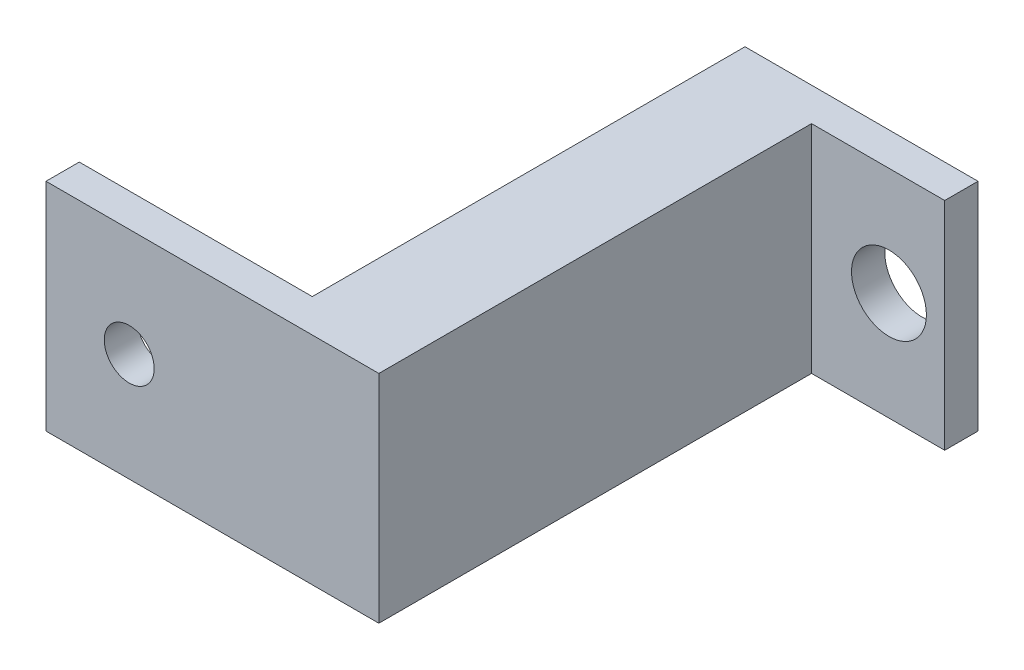
ISO-10303-21;
HEADER;
FILE_DESCRIPTION(('STEP AP214'),'2;1');
FILE_NAME('part.step','',(''),(''),'','','');
FILE_SCHEMA(('AUTOMOTIVE_DESIGN { 1 0 10303 214 1 1 1 1 }'));
ENDSEC;
DATA;
#1=APPLICATION_CONTEXT('core data for automotive mechanical design processes');
#2=APPLICATION_PROTOCOL_DEFINITION('international standard','automotive_design',2000,#1);
#3=PRODUCT_CONTEXT('',#1,'mechanical');
#4=PRODUCT('Part','Part','',(#3));
#5=PRODUCT_RELATED_PRODUCT_CATEGORY('part','',(#4));
#6=PRODUCT_DEFINITION_FORMATION('','',#4);
#7=PRODUCT_DEFINITION_CONTEXT('part definition',#1,'design');
#8=PRODUCT_DEFINITION('design','',#6,#7);
#9=PRODUCT_DEFINITION_SHAPE('','',#8);
#10=(LENGTH_UNIT() NAMED_UNIT(*) SI_UNIT(.MILLI.,.METRE.));
#11=(NAMED_UNIT(*) PLANE_ANGLE_UNIT() SI_UNIT($,.RADIAN.));
#12=(NAMED_UNIT(*) SI_UNIT($,.STERADIAN.) SOLID_ANGLE_UNIT());
#13=UNCERTAINTY_MEASURE_WITH_UNIT(LENGTH_MEASURE(1.E-05),#10,'distance_accuracy_value','');
#14=(GEOMETRIC_REPRESENTATION_CONTEXT(3) GLOBAL_UNCERTAINTY_ASSIGNED_CONTEXT((#13)) GLOBAL_UNIT_ASSIGNED_CONTEXT((#10,
#11,#12)) REPRESENTATION_CONTEXT('',''));
#15=CARTESIAN_POINT('',(0.,0.,0.));
#16=DIRECTION('',(0.,0.,1.));
#17=DIRECTION('',(1.,0.,0.));
#18=AXIS2_PLACEMENT_3D('',#15,#16,#17);
#19=CARTESIAN_POINT('',(0.,0.,2.));
#20=DIRECTION('',(0.,0.,-1.));
#21=DIRECTION('',(-1.,0.,0.));
#22=AXIS2_PLACEMENT_3D('',#19,#20,#21);
#23=PLANE('',#22);
#24=CARTESIAN_POINT('',(3.65,0.,2.));
#25=DIRECTION('',(0.,0.,1.));
#26=DIRECTION('',(1.,0.,0.));
#27=AXIS2_PLACEMENT_3D('',#24,#25,#26);
#28=CIRCLE('',#27,2.25);
#29=CARTESIAN_POINT('',(5.9,0.,2.));
#30=VERTEX_POINT('',#29);
#31=EDGE_CURVE('E105',#30,#30,#28,.T.);
#32=ORIENTED_EDGE('',*,*,#31,.F.);
#33=EDGE_LOOP('',(#32));
#34=FACE_BOUND('',#33,.T.);
#35=DIRECTION('',(0.,1.,0.));
#36=VECTOR('',#35,1.);
#37=CARTESIAN_POINT('',(-0.999999999999998,6.5,2.));
#38=LINE('',#37,#36);
#39=CARTESIAN_POINT('',(-0.999999999999997,-6.5,2.));
#40=VERTEX_POINT('',#39);
#41=CARTESIAN_POINT('',(-0.999999999999998,6.5,2.));
#42=VERTEX_POINT('',#41);
#43=EDGE_CURVE('E55',#40,#42,#38,.T.);
#44=ORIENTED_EDGE('',*,*,#43,.F.);
#45=DIRECTION('',(1.,0.,0.));
#46=VECTOR('',#45,1.);
#47=CARTESIAN_POINT('',(-7.,-6.5,2.));
#48=LINE('',#47,#46);
#49=CARTESIAN_POINT('',(7.,-6.5,2.));
#50=VERTEX_POINT('',#49);
#51=EDGE_CURVE('E60',#40,#50,#48,.T.);
#52=ORIENTED_EDGE('',*,*,#51,.T.);
#53=DIRECTION('',(0.,1.,0.));
#54=VECTOR('',#53,1.);
#55=CARTESIAN_POINT('',(7.,-6.5,2.));
#56=LINE('',#55,#54);
#57=CARTESIAN_POINT('',(7.,6.5,2.));
#58=VERTEX_POINT('',#57);
#59=EDGE_CURVE('E92',#50,#58,#56,.T.);
#60=ORIENTED_EDGE('',*,*,#59,.T.);
#61=DIRECTION('',(-1.,0.,0.));
#62=VECTOR('',#61,1.);
#63=CARTESIAN_POINT('',(-7.,6.5,2.));
#64=LINE('',#63,#62);
#65=EDGE_CURVE('E214',#58,#42,#64,.T.);
#66=ORIENTED_EDGE('',*,*,#65,.T.);
#67=EDGE_LOOP('',(#44,#52,#60,#66));
#68=FACE_BOUND('',#67,.T.);
#69=ADVANCED_FACE('F39',(#34,#68),#23,.F.);
#70=CARTESIAN_POINT('',(0.,0.,0.));
#71=DIRECTION('',(0.,0.,-1.));
#72=DIRECTION('',(-1.,0.,0.));
#73=AXIS2_PLACEMENT_3D('',#70,#71,#72);
#74=PLANE('',#73);
#75=DIRECTION('',(0.,1.,0.));
#76=VECTOR('',#75,1.);
#77=CARTESIAN_POINT('',(7.,-6.5,0.));
#78=LINE('',#77,#76);
#79=CARTESIAN_POINT('',(7.,-6.5,0.));
#80=VERTEX_POINT('',#79);
#81=CARTESIAN_POINT('',(7.,6.5,0.));
#82=VERTEX_POINT('',#81);
#83=EDGE_CURVE('E98',#80,#82,#78,.T.);
#84=ORIENTED_EDGE('',*,*,#83,.F.);
#85=DIRECTION('',(1.,0.,0.));
#86=VECTOR('',#85,1.);
#87=CARTESIAN_POINT('',(-7.,-6.5,0.));
#88=LINE('',#87,#86);
#89=CARTESIAN_POINT('',(-7.,-6.5,0.));
#90=VERTEX_POINT('',#89);
#91=EDGE_CURVE('E80',#90,#80,#88,.T.);
#92=ORIENTED_EDGE('',*,*,#91,.F.);
#93=DIRECTION('',(0.,-1.,0.));
#94=VECTOR('',#93,1.);
#95=CARTESIAN_POINT('',(-7.,-6.5,0.));
#96=LINE('',#95,#94);
#97=CARTESIAN_POINT('',(-7.,6.5,0.));
#98=VERTEX_POINT('',#97);
#99=EDGE_CURVE('E93',#98,#90,#96,.T.);
#100=ORIENTED_EDGE('',*,*,#99,.F.);
#101=DIRECTION('',(-1.,0.,0.));
#102=VECTOR('',#101,1.);
#103=CARTESIAN_POINT('',(-7.,6.5,0.));
#104=LINE('',#103,#102);
#105=EDGE_CURVE('E103',#82,#98,#104,.T.);
#106=ORIENTED_EDGE('',*,*,#105,.F.);
#107=EDGE_LOOP('',(#84,#92,#100,#106));
#108=FACE_BOUND('',#107,.T.);
#109=CARTESIAN_POINT('',(3.65,0.,0.));
#110=DIRECTION('',(0.,0.,1.));
#111=DIRECTION('',(1.,0.,0.));
#112=AXIS2_PLACEMENT_3D('',#109,#110,#111);
#113=CIRCLE('',#112,2.25);
#114=CARTESIAN_POINT('',(5.9,0.,0.));
#115=VERTEX_POINT('',#114);
#116=EDGE_CURVE('E111',#115,#115,#113,.T.);
#117=ORIENTED_EDGE('',*,*,#116,.T.);
#118=EDGE_LOOP('',(#117));
#119=FACE_BOUND('',#118,.T.);
#120=ADVANCED_FACE('F101',(#108,#119),#74,.T.);
#121=CARTESIAN_POINT('',(7.,-6.5,2.));
#122=DIRECTION('',(-1.,0.,0.));
#123=DIRECTION('',(0.,0.,1.));
#124=AXIS2_PLACEMENT_3D('',#121,#122,#123);
#125=PLANE('',#124);
#126=ORIENTED_EDGE('',*,*,#83,.T.);
#127=DIRECTION('',(0.,0.,-1.));
#128=VECTOR('',#127,1.);
#129=CARTESIAN_POINT('',(7.,6.5,2.));
#130=LINE('',#129,#128);
#131=EDGE_CURVE('E11',#58,#82,#130,.T.);
#132=ORIENTED_EDGE('',*,*,#131,.F.);
#133=ORIENTED_EDGE('',*,*,#59,.F.);
#134=DIRECTION('',(0.,0.,-1.));
#135=VECTOR('',#134,1.);
#136=CARTESIAN_POINT('',(7.,-6.5,2.));
#137=LINE('',#136,#135);
#138=EDGE_CURVE('E83',#50,#80,#137,.T.);
#139=ORIENTED_EDGE('',*,*,#138,.T.);
#140=EDGE_LOOP('',(#126,#132,#133,#139));
#141=FACE_BOUND('',#140,.T.);
#142=ADVANCED_FACE('F41',(#141),#125,.F.);
#143=CARTESIAN_POINT('',(-7.,6.5,2.));
#144=DIRECTION('',(0.,-1.,0.));
#145=DIRECTION('',(0.,0.,-1.));
#146=AXIS2_PLACEMENT_3D('',#143,#144,#145);
#147=PLANE('',#146);
#148=ORIENTED_EDGE('',*,*,#105,.T.);
#149=DIRECTION('',(0.,0.,-1.));
#150=VECTOR('',#149,1.);
#151=CARTESIAN_POINT('',(-7.,6.5,2.));
#152=LINE('',#151,#150);
#153=CARTESIAN_POINT('',(-7.,6.5,26.));
#154=VERTEX_POINT('',#153);
#155=EDGE_CURVE('E48',#154,#98,#152,.T.);
#156=ORIENTED_EDGE('',*,*,#155,.F.);
#157=DIRECTION('',(-1.,0.,0.));
#158=VECTOR('',#157,1.);
#159=CARTESIAN_POINT('',(-0.999999999999998,6.5,26.));
#160=LINE('',#159,#158);
#161=CARTESIAN_POINT('',(-21.,6.5,26.));
#162=VERTEX_POINT('',#161);
#163=EDGE_CURVE('E133',#154,#162,#160,.T.);
#164=ORIENTED_EDGE('',*,*,#163,.T.);
#165=DIRECTION('',(0.,0.,-1.));
#166=VECTOR('',#165,1.);
#167=CARTESIAN_POINT('',(-21.,6.5,28.));
#168=LINE('',#167,#166);
#169=CARTESIAN_POINT('',(-21.,6.5,28.));
#170=VERTEX_POINT('',#169);
#171=EDGE_CURVE('E168',#170,#162,#168,.T.);
#172=ORIENTED_EDGE('',*,*,#171,.F.);
#173=DIRECTION('',(-1.,0.,0.));
#174=VECTOR('',#173,1.);
#175=CARTESIAN_POINT('',(-0.999999999999998,6.5,28.));
#176=LINE('',#175,#174);
#177=CARTESIAN_POINT('',(-0.999999999999998,6.5,28.));
#178=VERTEX_POINT('',#177);
#179=EDGE_CURVE('E167',#178,#170,#176,.T.);
#180=ORIENTED_EDGE('',*,*,#179,.F.);
#181=DIRECTION('',(0.,0.,-1.));
#182=VECTOR('',#181,1.);
#183=CARTESIAN_POINT('',(-0.999999999999998,6.5,26.));
#184=LINE('',#183,#182);
#185=EDGE_CURVE('E158',#178,#42,#184,.T.);
#186=ORIENTED_EDGE('',*,*,#185,.T.);
#187=ORIENTED_EDGE('',*,*,#65,.F.);
#188=ORIENTED_EDGE('',*,*,#131,.T.);
#189=EDGE_LOOP('',(#148,#156,#164,#172,#180,#186,#187,#188));
#190=FACE_BOUND('',#189,.T.);
#191=ADVANCED_FACE('F130',(#190),#147,.F.);
#192=CARTESIAN_POINT('',(-7.,-6.5,2.));
#193=DIRECTION('',(1.,0.,0.));
#194=DIRECTION('',(0.,0.,-1.));
#195=AXIS2_PLACEMENT_3D('',#192,#193,#194);
#196=PLANE('',#195);
#197=ORIENTED_EDGE('',*,*,#99,.T.);
#198=DIRECTION('',(0.,0.,-1.));
#199=VECTOR('',#198,1.);
#200=CARTESIAN_POINT('',(-7.,-6.5,2.));
#201=LINE('',#200,#199);
#202=CARTESIAN_POINT('',(-7.,-6.5,26.));
#203=VERTEX_POINT('',#202);
#204=EDGE_CURVE('E87',#203,#90,#201,.T.);
#205=ORIENTED_EDGE('',*,*,#204,.F.);
#206=DIRECTION('',(0.,-1.,0.));
#207=VECTOR('',#206,1.);
#208=CARTESIAN_POINT('',(-7.,6.5,26.));
#209=LINE('',#208,#207);
#210=EDGE_CURVE('E126',#154,#203,#209,.T.);
#211=ORIENTED_EDGE('',*,*,#210,.F.);
#212=ORIENTED_EDGE('',*,*,#155,.T.);
#213=EDGE_LOOP('',(#197,#205,#211,#212));
#214=FACE_BOUND('',#213,.T.);
#215=ADVANCED_FACE('F124',(#214),#196,.F.);
#216=CARTESIAN_POINT('',(-7.,-6.5,2.));
#217=DIRECTION('',(0.,1.,0.));
#218=DIRECTION('',(0.,0.,1.));
#219=AXIS2_PLACEMENT_3D('',#216,#217,#218);
#220=PLANE('',#219);
#221=ORIENTED_EDGE('',*,*,#91,.T.);
#222=ORIENTED_EDGE('',*,*,#138,.F.);
#223=ORIENTED_EDGE('',*,*,#51,.F.);
#224=DIRECTION('',(0.,0.,-1.));
#225=VECTOR('',#224,1.);
#226=CARTESIAN_POINT('',(-0.999999999999997,-6.5,26.));
#227=LINE('',#226,#225);
#228=CARTESIAN_POINT('',(-0.999999999999997,-6.5,28.));
#229=VERTEX_POINT('',#228);
#230=EDGE_CURVE('E165',#229,#40,#227,.T.);
#231=ORIENTED_EDGE('',*,*,#230,.F.);
#232=DIRECTION('',(1.,0.,0.));
#233=VECTOR('',#232,1.);
#234=CARTESIAN_POINT('',(-0.999999999999997,-6.5,28.));
#235=LINE('',#234,#233);
#236=CARTESIAN_POINT('',(-21.,-6.5,28.));
#237=VERTEX_POINT('',#236);
#238=EDGE_CURVE('E178',#237,#229,#235,.T.);
#239=ORIENTED_EDGE('',*,*,#238,.F.);
#240=DIRECTION('',(0.,0.,-1.));
#241=VECTOR('',#240,1.);
#242=CARTESIAN_POINT('',(-21.,-6.5,28.));
#243=LINE('',#242,#241);
#244=CARTESIAN_POINT('',(-21.,-6.5,26.));
#245=VERTEX_POINT('',#244);
#246=EDGE_CURVE('E193',#237,#245,#243,.T.);
#247=ORIENTED_EDGE('',*,*,#246,.T.);
#248=DIRECTION('',(1.,0.,0.));
#249=VECTOR('',#248,1.);
#250=CARTESIAN_POINT('',(-0.999999999999997,-6.5,26.));
#251=LINE('',#250,#249);
#252=EDGE_CURVE('E180',#245,#203,#251,.T.);
#253=ORIENTED_EDGE('',*,*,#252,.T.);
#254=ORIENTED_EDGE('',*,*,#204,.T.);
#255=EDGE_LOOP('',(#221,#222,#223,#231,#239,#247,#253,#254));
#256=FACE_BOUND('',#255,.T.);
#257=ADVANCED_FACE('F82',(#256),#220,.F.);
#258=CARTESIAN_POINT('',(3.65,0.,2.));
#259=DIRECTION('',(0.,0.,-1.));
#260=DIRECTION('',(-1.,0.,0.));
#261=AXIS2_PLACEMENT_3D('',#258,#259,#260);
#262=CYLINDRICAL_SURFACE('',#261,2.25);
#263=ORIENTED_EDGE('',*,*,#31,.T.);
#264=EDGE_LOOP('',(#263));
#265=FACE_BOUND('',#264,.T.);
#266=ORIENTED_EDGE('',*,*,#116,.F.);
#267=EDGE_LOOP('',(#266));
#268=FACE_BOUND('',#267,.T.);
#269=ADVANCED_FACE('F226',(#265,#268),#262,.F.);
#270=CARTESIAN_POINT('',(-0.999999999999998,6.5,26.));
#271=DIRECTION('',(-1.,0.,0.));
#272=DIRECTION('',(0.,-1.,0.));
#273=AXIS2_PLACEMENT_3D('',#270,#271,#272);
#274=PLANE('',#273);
#275=ORIENTED_EDGE('',*,*,#43,.T.);
#276=ORIENTED_EDGE('',*,*,#185,.F.);
#277=DIRECTION('',(0.,1.,0.));
#278=VECTOR('',#277,1.);
#279=CARTESIAN_POINT('',(-0.999999999999998,6.5,28.));
#280=LINE('',#279,#278);
#281=EDGE_CURVE('E163',#229,#178,#280,.T.);
#282=ORIENTED_EDGE('',*,*,#281,.F.);
#283=ORIENTED_EDGE('',*,*,#230,.T.);
#284=EDGE_LOOP('',(#275,#276,#282,#283));
#285=FACE_BOUND('',#284,.T.);
#286=ADVANCED_FACE('F160',(#285),#274,.F.);
#287=CARTESIAN_POINT('',(0.,0.,28.));
#288=DIRECTION('',(0.,0.,-1.));
#289=DIRECTION('',(-1.,0.,0.));
#290=AXIS2_PLACEMENT_3D('',#287,#288,#289);
#291=PLANE('',#290);
#292=ORIENTED_EDGE('',*,*,#281,.T.);
#293=ORIENTED_EDGE('',*,*,#179,.T.);
#294=DIRECTION('',(0.,-1.,0.));
#295=VECTOR('',#294,1.);
#296=CARTESIAN_POINT('',(-21.,6.5,28.));
#297=LINE('',#296,#295);
#298=EDGE_CURVE('E172',#170,#237,#297,.T.);
#299=ORIENTED_EDGE('',*,*,#298,.T.);
#300=ORIENTED_EDGE('',*,*,#238,.T.);
#301=EDGE_LOOP('',(#292,#293,#299,#300));
#302=FACE_BOUND('',#301,.T.);
#303=CARTESIAN_POINT('',(-16.,0.,28.));
#304=DIRECTION('',(0.,0.,1.));
#305=DIRECTION('',(1.,0.,0.));
#306=AXIS2_PLACEMENT_3D('',#303,#304,#305);
#307=CIRCLE('',#306,1.5);
#308=CARTESIAN_POINT('',(-14.5,0.,28.));
#309=VERTEX_POINT('',#308);
#310=EDGE_CURVE('E196',#309,#309,#307,.T.);
#311=ORIENTED_EDGE('',*,*,#310,.F.);
#312=EDGE_LOOP('',(#311));
#313=FACE_BOUND('',#312,.T.);
#314=ADVANCED_FACE('F175',(#302,#313),#291,.F.);
#315=CARTESIAN_POINT('',(0.,0.,26.));
#316=DIRECTION('',(0.,0.,-1.));
#317=DIRECTION('',(-1.,0.,0.));
#318=AXIS2_PLACEMENT_3D('',#315,#316,#317);
#319=PLANE('',#318);
#320=ORIENTED_EDGE('',*,*,#163,.F.);
#321=ORIENTED_EDGE('',*,*,#210,.T.);
#322=ORIENTED_EDGE('',*,*,#252,.F.);
#323=DIRECTION('',(0.,-1.,0.));
#324=VECTOR('',#323,1.);
#325=CARTESIAN_POINT('',(-21.,6.5,26.));
#326=LINE('',#325,#324);
#327=EDGE_CURVE('E183',#162,#245,#326,.T.);
#328=ORIENTED_EDGE('',*,*,#327,.F.);
#329=EDGE_LOOP('',(#320,#321,#322,#328));
#330=FACE_BOUND('',#329,.T.);
#331=CARTESIAN_POINT('',(-16.,0.,26.));
#332=DIRECTION('',(0.,0.,1.));
#333=DIRECTION('',(1.,0.,0.));
#334=AXIS2_PLACEMENT_3D('',#331,#332,#333);
#335=CIRCLE('',#334,1.5);
#336=CARTESIAN_POINT('',(-14.5,0.,26.));
#337=VERTEX_POINT('',#336);
#338=EDGE_CURVE('E186',#337,#337,#335,.T.);
#339=ORIENTED_EDGE('',*,*,#338,.T.);
#340=EDGE_LOOP('',(#339));
#341=FACE_BOUND('',#340,.T.);
#342=ADVANCED_FACE('F303',(#330,#341),#319,.T.);
#343=CARTESIAN_POINT('',(-21.,6.5,28.));
#344=DIRECTION('',(1.,0.,0.));
#345=DIRECTION('',(0.,0.,-1.));
#346=AXIS2_PLACEMENT_3D('',#343,#344,#345);
#347=PLANE('',#346);
#348=ORIENTED_EDGE('',*,*,#327,.T.);
#349=ORIENTED_EDGE('',*,*,#246,.F.);
#350=ORIENTED_EDGE('',*,*,#298,.F.);
#351=ORIENTED_EDGE('',*,*,#171,.T.);
#352=EDGE_LOOP('',(#348,#349,#350,#351));
#353=FACE_BOUND('',#352,.T.);
#354=ADVANCED_FACE('F312',(#353),#347,.F.);
#355=CARTESIAN_POINT('',(-16.,0.,28.));
#356=DIRECTION('',(0.,0.,-1.));
#357=DIRECTION('',(-1.,0.,0.));
#358=AXIS2_PLACEMENT_3D('',#355,#356,#357);
#359=CYLINDRICAL_SURFACE('',#358,1.5);
#360=ORIENTED_EDGE('',*,*,#310,.T.);
#361=EDGE_LOOP('',(#360));
#362=FACE_BOUND('',#361,.T.);
#363=ORIENTED_EDGE('',*,*,#338,.F.);
#364=EDGE_LOOP('',(#363));
#365=FACE_BOUND('',#364,.T.);
#366=ADVANCED_FACE('F322',(#362,#365),#359,.F.);
#367=CLOSED_SHELL('',(#69,#120,#142,#191,#215,#257,#269,#286,#314,#342,#354,#366));
#368=MANIFOLD_SOLID_BREP('B2',#367);
#369=ADVANCED_BREP_SHAPE_REPRESENTATION('',(#18,#368),#14);
#370=SHAPE_DEFINITION_REPRESENTATION(#9,#369);
ENDSEC;
END-ISO-10303-21;
